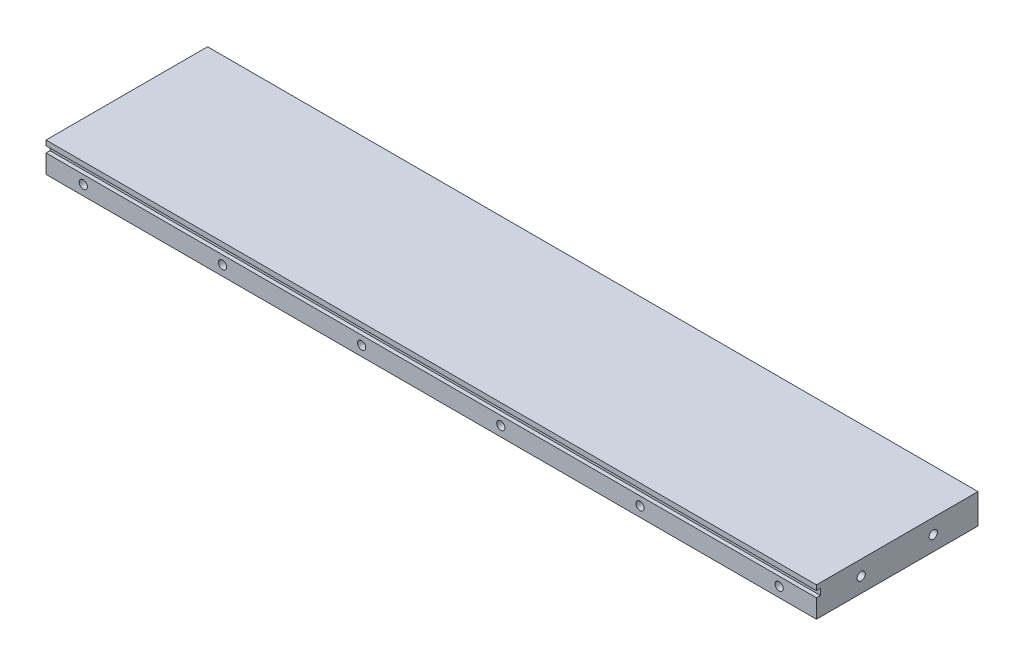
ISO-10303-21;
HEADER;
FILE_DESCRIPTION(('STEP AP214'),'2;1');
FILE_NAME('part.step','',(''),(''),'','','');
FILE_SCHEMA(('AUTOMOTIVE_DESIGN { 1 0 10303 214 1 1 1 1 }'));
ENDSEC;
DATA;
#1=APPLICATION_CONTEXT('core data for automotive mechanical design processes');
#2=APPLICATION_PROTOCOL_DEFINITION('international standard','automotive_design',2000,#1);
#3=PRODUCT_CONTEXT('',#1,'mechanical');
#4=PRODUCT('Part','Part','',(#3));
#5=PRODUCT_RELATED_PRODUCT_CATEGORY('part','',(#4));
#6=PRODUCT_DEFINITION_FORMATION('','',#4);
#7=PRODUCT_DEFINITION_CONTEXT('part definition',#1,'design');
#8=PRODUCT_DEFINITION('design','',#6,#7);
#9=PRODUCT_DEFINITION_SHAPE('','',#8);
#10=(LENGTH_UNIT() NAMED_UNIT(*) SI_UNIT(.MILLI.,.METRE.));
#11=(NAMED_UNIT(*) PLANE_ANGLE_UNIT() SI_UNIT($,.RADIAN.));
#12=(NAMED_UNIT(*) SI_UNIT($,.STERADIAN.) SOLID_ANGLE_UNIT());
#13=UNCERTAINTY_MEASURE_WITH_UNIT(LENGTH_MEASURE(1.E-05),#10,'distance_accuracy_value','');
#14=(GEOMETRIC_REPRESENTATION_CONTEXT(3) GLOBAL_UNCERTAINTY_ASSIGNED_CONTEXT((#13)) GLOBAL_UNIT_ASSIGNED_CONTEXT((#10,
#11,#12)) REPRESENTATION_CONTEXT('',''));
#15=CARTESIAN_POINT('',(0.,0.,0.));
#16=DIRECTION('',(0.,0.,1.));
#17=DIRECTION('',(1.,0.,0.));
#18=AXIS2_PLACEMENT_3D('',#15,#16,#17);
#19=CARTESIAN_POINT('',(0.,0.,0.));
#20=DIRECTION('',(0.,0.,-1.));
#21=DIRECTION('',(-1.,0.,0.));
#22=AXIS2_PLACEMENT_3D('',#19,#20,#21);
#23=PLANE('',#22);
#24=CARTESIAN_POINT('',(15.,4.,0.));
#25=DIRECTION('',(0.,0.,1.));
#26=DIRECTION('',(1.,0.,0.));
#27=AXIS2_PLACEMENT_3D('',#24,#25,#26);
#28=CIRCLE('',#27,1.65);
#29=CARTESIAN_POINT('',(16.65,4.,0.));
#30=VERTEX_POINT('',#29);
#31=EDGE_CURVE('E218',#30,#30,#28,.T.);
#32=ORIENTED_EDGE('',*,*,#31,.F.);
#33=EDGE_LOOP('',(#32));
#34=FACE_BOUND('',#33,.T.);
#35=CARTESIAN_POINT('',(71.,4.,0.));
#36=DIRECTION('',(0.,0.,1.));
#37=DIRECTION('',(1.,0.,0.));
#38=AXIS2_PLACEMENT_3D('',#35,#36,#37);
#39=CIRCLE('',#38,1.65);
#40=CARTESIAN_POINT('',(72.65,4.,0.));
#41=VERTEX_POINT('',#40);
#42=EDGE_CURVE('E226',#41,#41,#39,.T.);
#43=ORIENTED_EDGE('',*,*,#42,.F.);
#44=EDGE_LOOP('',(#43));
#45=FACE_BOUND('',#44,.T.);
#46=CARTESIAN_POINT('',(127.,4.,0.));
#47=DIRECTION('',(0.,0.,1.));
#48=DIRECTION('',(1.,0.,0.));
#49=AXIS2_PLACEMENT_3D('',#46,#47,#48);
#50=CIRCLE('',#49,1.64999999999998);
#51=CARTESIAN_POINT('',(128.65,4.,0.));
#52=VERTEX_POINT('',#51);
#53=EDGE_CURVE('E233',#52,#52,#50,.T.);
#54=ORIENTED_EDGE('',*,*,#53,.F.);
#55=EDGE_LOOP('',(#54));
#56=FACE_BOUND('',#55,.T.);
#57=CARTESIAN_POINT('',(183.,4.,0.));
#58=DIRECTION('',(0.,0.,1.));
#59=DIRECTION('',(1.,0.,0.));
#60=AXIS2_PLACEMENT_3D('',#57,#58,#59);
#61=CIRCLE('',#60,1.64999999999998);
#62=CARTESIAN_POINT('',(184.65,4.,0.));
#63=VERTEX_POINT('',#62);
#64=EDGE_CURVE('E241',#63,#63,#61,.T.);
#65=ORIENTED_EDGE('',*,*,#64,.F.);
#66=EDGE_LOOP('',(#65));
#67=FACE_BOUND('',#66,.T.);
#68=CARTESIAN_POINT('',(239.,4.,0.));
#69=DIRECTION('',(0.,0.,1.));
#70=DIRECTION('',(1.,0.,0.));
#71=AXIS2_PLACEMENT_3D('',#68,#69,#70);
#72=CIRCLE('',#71,1.64999999999998);
#73=CARTESIAN_POINT('',(240.65,4.,0.));
#74=VERTEX_POINT('',#73);
#75=EDGE_CURVE('E249',#74,#74,#72,.T.);
#76=ORIENTED_EDGE('',*,*,#75,.F.);
#77=EDGE_LOOP('',(#76));
#78=FACE_BOUND('',#77,.T.);
#79=CARTESIAN_POINT('',(295.,4.,0.));
#80=DIRECTION('',(0.,0.,1.));
#81=DIRECTION('',(1.,0.,0.));
#82=AXIS2_PLACEMENT_3D('',#79,#80,#81);
#83=CIRCLE('',#82,1.64999999999998);
#84=CARTESIAN_POINT('',(296.65,4.,0.));
#85=VERTEX_POINT('',#84);
#86=EDGE_CURVE('E257',#85,#85,#83,.T.);
#87=ORIENTED_EDGE('',*,*,#86,.F.);
#88=EDGE_LOOP('',(#87));
#89=FACE_BOUND('',#88,.T.);
#90=DIRECTION('',(0.,1.,0.));
#91=VECTOR('',#90,1.);
#92=CARTESIAN_POINT('',(310.,0.,0.));
#93=LINE('',#92,#91);
#94=CARTESIAN_POINT('',(310.,0.,0.));
#95=VERTEX_POINT('',#94);
#96=CARTESIAN_POINT('',(310.,7.5,0.));
#97=VERTEX_POINT('',#96);
#98=EDGE_CURVE('E322',#95,#97,#93,.T.);
#99=ORIENTED_EDGE('',*,*,#98,.T.);
#100=DIRECTION('',(1.,0.,0.));
#101=VECTOR('',#100,1.);
#102=CARTESIAN_POINT('',(310.,7.5,0.));
#103=LINE('',#102,#101);
#104=CARTESIAN_POINT('',(0.,7.49999999999996,0.));
#105=VERTEX_POINT('',#104);
#106=EDGE_CURVE('E270',#105,#97,#103,.T.);
#107=ORIENTED_EDGE('',*,*,#106,.F.);
#108=DIRECTION('',(0.,-1.,0.));
#109=VECTOR('',#108,1.);
#110=CARTESIAN_POINT('',(0.,0.,0.));
#111=LINE('',#110,#109);
#112=CARTESIAN_POINT('',(0.,0.,0.));
#113=VERTEX_POINT('',#112);
#114=EDGE_CURVE('E289',#105,#113,#111,.T.);
#115=ORIENTED_EDGE('',*,*,#114,.T.);
#116=DIRECTION('',(1.,0.,0.));
#117=VECTOR('',#116,1.);
#118=CARTESIAN_POINT('',(0.,0.,0.));
#119=LINE('',#118,#117);
#120=EDGE_CURVE('E317',#113,#95,#119,.T.);
#121=ORIENTED_EDGE('',*,*,#120,.T.);
#122=EDGE_LOOP('',(#99,#107,#115,#121));
#123=FACE_BOUND('',#122,.T.);
#124=ADVANCED_FACE('F48',(#34,#45,#56,#67,#78,#89,#123),#23,.F.);
#125=CARTESIAN_POINT('',(0.,0.,-65.));
#126=DIRECTION('',(-1.,0.,0.));
#127=DIRECTION('',(0.,0.,1.));
#128=AXIS2_PLACEMENT_3D('',#125,#126,#127);
#129=PLANE('',#128);
#130=CARTESIAN_POINT('',(0.,6.,-18.));
#131=DIRECTION('',(-1.,0.,0.));
#132=DIRECTION('',(0.,0.,1.));
#133=AXIS2_PLACEMENT_3D('',#130,#131,#132);
#134=CIRCLE('',#133,1.64999999999999);
#135=CARTESIAN_POINT('',(0.,6.,-16.35));
#136=VERTEX_POINT('',#135);
#137=EDGE_CURVE('E203',#136,#136,#134,.T.);
#138=ORIENTED_EDGE('',*,*,#137,.F.);
#139=EDGE_LOOP('',(#138));
#140=FACE_BOUND('',#139,.T.);
#141=CARTESIAN_POINT('',(0.,6.00000000000007,-47.));
#142=DIRECTION('',(-1.,0.,0.));
#143=DIRECTION('',(0.,0.,1.));
#144=AXIS2_PLACEMENT_3D('',#141,#142,#143);
#145=CIRCLE('',#144,1.64999999999999);
#146=CARTESIAN_POINT('',(0.,6.00000000000007,-45.35));
#147=VERTEX_POINT('',#146);
#148=EDGE_CURVE('E210',#147,#147,#145,.T.);
#149=ORIENTED_EDGE('',*,*,#148,.F.);
#150=EDGE_LOOP('',(#149));
#151=FACE_BOUND('',#150,.T.);
#152=DIRECTION('',(0.,0.,1.));
#153=VECTOR('',#152,1.);
#154=CARTESIAN_POINT('',(0.,7.49999999999996,-1.6));
#155=LINE('',#154,#153);
#156=CARTESIAN_POINT('',(0.,7.49999999999996,-1.6));
#157=VERTEX_POINT('',#156);
#158=EDGE_CURVE('E290',#157,#105,#155,.T.);
#159=ORIENTED_EDGE('',*,*,#158,.F.);
#160=DIRECTION('',(0.,-1.,0.));
#161=VECTOR('',#160,1.);
#162=CARTESIAN_POINT('',(0.,9.99999999999996,-1.6));
#163=LINE('',#162,#161);
#164=CARTESIAN_POINT('',(0.,9.99999999999996,-1.6));
#165=VERTEX_POINT('',#164);
#166=EDGE_CURVE('E274',#165,#157,#163,.T.);
#167=ORIENTED_EDGE('',*,*,#166,.F.);
#168=DIRECTION('',(0.,0.,1.));
#169=VECTOR('',#168,1.);
#170=CARTESIAN_POINT('',(0.,9.99999999999996,-1.6));
#171=LINE('',#170,#169);
#172=CARTESIAN_POINT('',(0.,9.99999999999996,0.));
#173=VERTEX_POINT('',#172);
#174=EDGE_CURVE('E293',#165,#173,#171,.T.);
#175=ORIENTED_EDGE('',*,*,#174,.T.);
#176=CARTESIAN_POINT('',(0.,12.,0.));
#177=VERTEX_POINT('',#176);
#178=EDGE_CURVE('E313',#177,#173,#111,.T.);
#179=ORIENTED_EDGE('',*,*,#178,.F.);
#180=DIRECTION('',(0.,0.,1.));
#181=VECTOR('',#180,1.);
#182=CARTESIAN_POINT('',(0.,12.,-65.));
#183=LINE('',#182,#181);
#184=CARTESIAN_POINT('',(0.,12.,-65.));
#185=VERTEX_POINT('',#184);
#186=EDGE_CURVE('E11',#185,#177,#183,.T.);
#187=ORIENTED_EDGE('',*,*,#186,.F.);
#188=DIRECTION('',(0.,-1.,0.));
#189=VECTOR('',#188,1.);
#190=CARTESIAN_POINT('',(0.,0.,-65.));
#191=LINE('',#190,#189);
#192=CARTESIAN_POINT('',(0.,0.,-65.));
#193=VERTEX_POINT('',#192);
#194=EDGE_CURVE('E299',#185,#193,#191,.T.);
#195=ORIENTED_EDGE('',*,*,#194,.T.);
#196=DIRECTION('',(0.,0.,1.));
#197=VECTOR('',#196,1.);
#198=CARTESIAN_POINT('',(0.,0.,-65.));
#199=LINE('',#198,#197);
#200=EDGE_CURVE('E52',#193,#113,#199,.T.);
#201=ORIENTED_EDGE('',*,*,#200,.T.);
#202=ORIENTED_EDGE('',*,*,#114,.F.);
#203=EDGE_LOOP('',(#159,#167,#175,#179,#187,#195,#201,#202));
#204=FACE_BOUND('',#203,.T.);
#205=ADVANCED_FACE('F50',(#140,#151,#204),#129,.T.);
#206=CARTESIAN_POINT('',(0.,12.,-65.));
#207=DIRECTION('',(0.,1.,0.));
#208=DIRECTION('',(0.,0.,1.));
#209=AXIS2_PLACEMENT_3D('',#206,#207,#208);
#210=PLANE('',#209);
#211=DIRECTION('',(-1.,0.,0.));
#212=VECTOR('',#211,1.);
#213=CARTESIAN_POINT('',(0.,12.,0.));
#214=LINE('',#213,#212);
#215=CARTESIAN_POINT('',(310.,12.,0.));
#216=VERTEX_POINT('',#215);
#217=EDGE_CURVE('E303',#216,#177,#214,.T.);
#218=ORIENTED_EDGE('',*,*,#217,.F.);
#219=DIRECTION('',(0.,0.,1.));
#220=VECTOR('',#219,1.);
#221=CARTESIAN_POINT('',(310.,12.,-65.));
#222=LINE('',#221,#220);
#223=CARTESIAN_POINT('',(310.,12.,-65.));
#224=VERTEX_POINT('',#223);
#225=EDGE_CURVE('E58',#224,#216,#222,.T.);
#226=ORIENTED_EDGE('',*,*,#225,.F.);
#227=DIRECTION('',(-1.,0.,0.));
#228=VECTOR('',#227,1.);
#229=CARTESIAN_POINT('',(0.,12.,-65.));
#230=LINE('',#229,#228);
#231=EDGE_CURVE('E310',#224,#185,#230,.T.);
#232=ORIENTED_EDGE('',*,*,#231,.T.);
#233=ORIENTED_EDGE('',*,*,#186,.T.);
#234=EDGE_LOOP('',(#218,#226,#232,#233));
#235=FACE_BOUND('',#234,.T.);
#236=ADVANCED_FACE('F353',(#235),#210,.T.);
#237=CARTESIAN_POINT('',(310.,0.,-65.));
#238=DIRECTION('',(1.,0.,0.));
#239=DIRECTION('',(0.,0.,-1.));
#240=AXIS2_PLACEMENT_3D('',#237,#238,#239);
#241=PLANE('',#240);
#242=CARTESIAN_POINT('',(310.,6.,-18.));
#243=DIRECTION('',(1.,0.,0.));
#244=DIRECTION('',(0.,0.,-1.));
#245=AXIS2_PLACEMENT_3D('',#242,#243,#244);
#246=CIRCLE('',#245,1.64999999999999);
#247=CARTESIAN_POINT('',(310.,6.,-19.65));
#248=VERTEX_POINT('',#247);
#249=EDGE_CURVE('E188',#248,#248,#246,.T.);
#250=ORIENTED_EDGE('',*,*,#249,.F.);
#251=EDGE_LOOP('',(#250));
#252=FACE_BOUND('',#251,.T.);
#253=CARTESIAN_POINT('',(310.,6.00000000000007,-47.));
#254=DIRECTION('',(1.,0.,0.));
#255=DIRECTION('',(0.,0.,-1.));
#256=AXIS2_PLACEMENT_3D('',#253,#254,#255);
#257=CIRCLE('',#256,1.64999999999999);
#258=CARTESIAN_POINT('',(310.,6.00000000000007,-48.65));
#259=VERTEX_POINT('',#258);
#260=EDGE_CURVE('E187',#259,#259,#257,.T.);
#261=ORIENTED_EDGE('',*,*,#260,.F.);
#262=EDGE_LOOP('',(#261));
#263=FACE_BOUND('',#262,.T.);
#264=DIRECTION('',(0.,0.,1.));
#265=VECTOR('',#264,1.);
#266=CARTESIAN_POINT('',(310.,7.5,-1.6));
#267=LINE('',#266,#265);
#268=CARTESIAN_POINT('',(310.,7.5,-1.6));
#269=VERTEX_POINT('',#268);
#270=EDGE_CURVE('E285',#269,#97,#267,.T.);
#271=ORIENTED_EDGE('',*,*,#270,.T.);
#272=ORIENTED_EDGE('',*,*,#98,.F.);
#273=DIRECTION('',(0.,0.,1.));
#274=VECTOR('',#273,1.);
#275=CARTESIAN_POINT('',(310.,0.,-65.));
#276=LINE('',#275,#274);
#277=CARTESIAN_POINT('',(310.,0.,-65.));
#278=VERTEX_POINT('',#277);
#279=EDGE_CURVE('E331',#278,#95,#276,.T.);
#280=ORIENTED_EDGE('',*,*,#279,.F.);
#281=DIRECTION('',(0.,1.,0.));
#282=VECTOR('',#281,1.);
#283=CARTESIAN_POINT('',(310.,0.,-65.));
#284=LINE('',#283,#282);
#285=EDGE_CURVE('E306',#278,#224,#284,.T.);
#286=ORIENTED_EDGE('',*,*,#285,.T.);
#287=ORIENTED_EDGE('',*,*,#225,.T.);
#288=CARTESIAN_POINT('',(310.,9.99999999999998,0.));
#289=VERTEX_POINT('',#288);
#290=EDGE_CURVE('E321',#289,#216,#93,.T.);
#291=ORIENTED_EDGE('',*,*,#290,.F.);
#292=DIRECTION('',(0.,0.,1.));
#293=VECTOR('',#292,1.);
#294=CARTESIAN_POINT('',(310.,10.,-1.6));
#295=LINE('',#294,#293);
#296=CARTESIAN_POINT('',(310.,10.,-1.6));
#297=VERTEX_POINT('',#296);
#298=EDGE_CURVE('E69',#297,#289,#295,.T.);
#299=ORIENTED_EDGE('',*,*,#298,.F.);
#300=DIRECTION('',(0.,1.,0.));
#301=VECTOR('',#300,1.);
#302=CARTESIAN_POINT('',(310.,10.,-1.6));
#303=LINE('',#302,#301);
#304=EDGE_CURVE('E265',#269,#297,#303,.T.);
#305=ORIENTED_EDGE('',*,*,#304,.F.);
#306=EDGE_LOOP('',(#271,#272,#280,#286,#287,#291,#299,#305));
#307=FACE_BOUND('',#306,.T.);
#308=ADVANCED_FACE('F346',(#252,#263,#307),#241,.T.);
#309=CARTESIAN_POINT('',(0.,0.,-65.));
#310=DIRECTION('',(0.,-1.,0.));
#311=DIRECTION('',(0.,0.,-1.));
#312=AXIS2_PLACEMENT_3D('',#309,#310,#311);
#313=PLANE('',#312);
#314=ORIENTED_EDGE('',*,*,#120,.F.);
#315=ORIENTED_EDGE('',*,*,#200,.F.);
#316=DIRECTION('',(1.,0.,0.));
#317=VECTOR('',#316,1.);
#318=CARTESIAN_POINT('',(0.,0.,-65.));
#319=LINE('',#318,#317);
#320=EDGE_CURVE('E302',#193,#278,#319,.T.);
#321=ORIENTED_EDGE('',*,*,#320,.T.);
#322=ORIENTED_EDGE('',*,*,#279,.T.);
#323=EDGE_LOOP('',(#314,#315,#321,#322));
#324=FACE_BOUND('',#323,.T.);
#325=ADVANCED_FACE('F338',(#324),#313,.T.);
#326=CARTESIAN_POINT('',(0.,0.,-65.));
#327=DIRECTION('',(0.,0.,-1.));
#328=DIRECTION('',(-1.,0.,0.));
#329=AXIS2_PLACEMENT_3D('',#326,#327,#328);
#330=PLANE('',#329);
#331=ORIENTED_EDGE('',*,*,#194,.F.);
#332=ORIENTED_EDGE('',*,*,#231,.F.);
#333=ORIENTED_EDGE('',*,*,#285,.F.);
#334=ORIENTED_EDGE('',*,*,#320,.F.);
#335=EDGE_LOOP('',(#331,#332,#333,#334));
#336=FACE_BOUND('',#335,.T.);
#337=ADVANCED_FACE('F357',(#336),#330,.T.);
#338=ORIENTED_EDGE('',*,*,#178,.T.);
#339=DIRECTION('',(-1.,0.,0.));
#340=VECTOR('',#339,1.);
#341=CARTESIAN_POINT('',(310.,10.,0.));
#342=LINE('',#341,#340);
#343=EDGE_CURVE('E264',#289,#173,#342,.T.);
#344=ORIENTED_EDGE('',*,*,#343,.F.);
#345=ORIENTED_EDGE('',*,*,#290,.T.);
#346=ORIENTED_EDGE('',*,*,#217,.T.);
#347=EDGE_LOOP('',(#338,#344,#345,#346));
#348=FACE_BOUND('',#347,.T.);
#349=ADVANCED_FACE('F352',(#348),#23,.F.);
#350=CARTESIAN_POINT('',(310.,7.5,-1.6));
#351=DIRECTION('',(0.,-1.,0.));
#352=DIRECTION('',(1.,0.,0.));
#353=AXIS2_PLACEMENT_3D('',#350,#351,#352);
#354=PLANE('',#353);
#355=ORIENTED_EDGE('',*,*,#106,.T.);
#356=ORIENTED_EDGE('',*,*,#270,.F.);
#357=DIRECTION('',(1.,0.,0.));
#358=VECTOR('',#357,1.);
#359=CARTESIAN_POINT('',(310.,7.5,-1.6));
#360=LINE('',#359,#358);
#361=EDGE_CURVE('E277',#157,#269,#360,.T.);
#362=ORIENTED_EDGE('',*,*,#361,.F.);
#363=ORIENTED_EDGE('',*,*,#158,.T.);
#364=EDGE_LOOP('',(#355,#356,#362,#363));
#365=FACE_BOUND('',#364,.T.);
#366=ADVANCED_FACE('F342',(#365),#354,.F.);
#367=CARTESIAN_POINT('',(310.,10.,-1.6));
#368=DIRECTION('',(0.,1.,0.));
#369=DIRECTION('',(-1.,0.,0.));
#370=AXIS2_PLACEMENT_3D('',#367,#368,#369);
#371=PLANE('',#370);
#372=ORIENTED_EDGE('',*,*,#343,.T.);
#373=ORIENTED_EDGE('',*,*,#174,.F.);
#374=DIRECTION('',(-1.,0.,0.));
#375=VECTOR('',#374,1.);
#376=CARTESIAN_POINT('',(310.,10.,-1.6));
#377=LINE('',#376,#375);
#378=EDGE_CURVE('E269',#297,#165,#377,.T.);
#379=ORIENTED_EDGE('',*,*,#378,.F.);
#380=ORIENTED_EDGE('',*,*,#298,.T.);
#381=EDGE_LOOP('',(#372,#373,#379,#380));
#382=FACE_BOUND('',#381,.T.);
#383=ADVANCED_FACE('F461',(#382),#371,.F.);
#384=CARTESIAN_POINT('',(0.,0.,-1.6));
#385=DIRECTION('',(0.,0.,-1.));
#386=DIRECTION('',(-1.,0.,0.));
#387=AXIS2_PLACEMENT_3D('',#384,#385,#386);
#388=PLANE('',#387);
#389=ORIENTED_EDGE('',*,*,#304,.T.);
#390=ORIENTED_EDGE('',*,*,#378,.T.);
#391=ORIENTED_EDGE('',*,*,#166,.T.);
#392=ORIENTED_EDGE('',*,*,#361,.T.);
#393=EDGE_LOOP('',(#389,#390,#391,#392));
#394=FACE_BOUND('',#393,.T.);
#395=ADVANCED_FACE('F349',(#394),#388,.F.);
#396=CARTESIAN_POINT('',(295.,4.,-11.5));
#397=DIRECTION('',(0.,0.,1.));
#398=DIRECTION('',(1.,0.,0.));
#399=AXIS2_PLACEMENT_3D('',#396,#397,#398);
#400=CONICAL_SURFACE('',#399,1.64999999999998,1.02974425867665);
#401=CARTESIAN_POINT('',(295.,4.,-12.4914200213955));
#402=VERTEX_POINT('',#401);
#403=VERTEX_LOOP('',#402);
#404=FACE_BOUND('',#403,.T.);
#405=CARTESIAN_POINT('',(295.,4.,-11.5));
#406=DIRECTION('',(0.,0.,1.));
#407=DIRECTION('',(1.,0.,0.));
#408=AXIS2_PLACEMENT_3D('',#405,#406,#407);
#409=CIRCLE('',#408,1.64999999999998);
#410=CARTESIAN_POINT('',(296.65,4.,-11.5));
#411=VERTEX_POINT('',#410);
#412=EDGE_CURVE('E261',#411,#411,#409,.T.);
#413=ORIENTED_EDGE('',*,*,#412,.T.);
#414=EDGE_LOOP('',(#413));
#415=FACE_BOUND('',#414,.T.);
#416=ADVANCED_FACE('F454',(#404,#415),#400,.F.);
#417=CARTESIAN_POINT('',(295.,4.,0.));
#418=DIRECTION('',(0.,0.,1.));
#419=DIRECTION('',(1.,0.,0.));
#420=AXIS2_PLACEMENT_3D('',#417,#418,#419);
#421=CYLINDRICAL_SURFACE('',#420,1.64999999999998);
#422=ORIENTED_EDGE('',*,*,#412,.F.);
#423=EDGE_LOOP('',(#422));
#424=FACE_BOUND('',#423,.T.);
#425=ORIENTED_EDGE('',*,*,#86,.T.);
#426=EDGE_LOOP('',(#425));
#427=FACE_BOUND('',#426,.T.);
#428=ADVANCED_FACE('F450',(#424,#427),#421,.F.);
#429=CARTESIAN_POINT('',(239.,4.,-11.5));
#430=DIRECTION('',(0.,0.,1.));
#431=DIRECTION('',(1.,0.,0.));
#432=AXIS2_PLACEMENT_3D('',#429,#430,#431);
#433=CONICAL_SURFACE('',#432,1.64999999999998,1.02974425867665);
#434=CARTESIAN_POINT('',(239.,4.,-12.4914200213955));
#435=VERTEX_POINT('',#434);
#436=VERTEX_LOOP('',#435);
#437=FACE_BOUND('',#436,.T.);
#438=CARTESIAN_POINT('',(239.,4.,-11.5));
#439=DIRECTION('',(0.,0.,1.));
#440=DIRECTION('',(1.,0.,0.));
#441=AXIS2_PLACEMENT_3D('',#438,#439,#440);
#442=CIRCLE('',#441,1.64999999999998);
#443=CARTESIAN_POINT('',(240.65,4.,-11.5));
#444=VERTEX_POINT('',#443);
#445=EDGE_CURVE('E253',#444,#444,#442,.T.);
#446=ORIENTED_EDGE('',*,*,#445,.T.);
#447=EDGE_LOOP('',(#446));
#448=FACE_BOUND('',#447,.T.);
#449=ADVANCED_FACE('F446',(#437,#448),#433,.F.);
#450=CARTESIAN_POINT('',(239.,4.,0.));
#451=DIRECTION('',(0.,0.,1.));
#452=DIRECTION('',(1.,0.,0.));
#453=AXIS2_PLACEMENT_3D('',#450,#451,#452);
#454=CYLINDRICAL_SURFACE('',#453,1.64999999999998);
#455=ORIENTED_EDGE('',*,*,#445,.F.);
#456=EDGE_LOOP('',(#455));
#457=FACE_BOUND('',#456,.T.);
#458=ORIENTED_EDGE('',*,*,#75,.T.);
#459=EDGE_LOOP('',(#458));
#460=FACE_BOUND('',#459,.T.);
#461=ADVANCED_FACE('F442',(#457,#460),#454,.F.);
#462=CARTESIAN_POINT('',(183.,4.,-11.5));
#463=DIRECTION('',(0.,0.,1.));
#464=DIRECTION('',(1.,0.,0.));
#465=AXIS2_PLACEMENT_3D('',#462,#463,#464);
#466=CONICAL_SURFACE('',#465,1.64999999999998,1.02974425867665);
#467=CARTESIAN_POINT('',(183.,4.,-12.4914200213955));
#468=VERTEX_POINT('',#467);
#469=VERTEX_LOOP('',#468);
#470=FACE_BOUND('',#469,.T.);
#471=CARTESIAN_POINT('',(183.,4.,-11.5));
#472=DIRECTION('',(0.,0.,1.));
#473=DIRECTION('',(1.,0.,0.));
#474=AXIS2_PLACEMENT_3D('',#471,#472,#473);
#475=CIRCLE('',#474,1.64999999999998);
#476=CARTESIAN_POINT('',(184.65,4.,-11.5));
#477=VERTEX_POINT('',#476);
#478=EDGE_CURVE('E245',#477,#477,#475,.T.);
#479=ORIENTED_EDGE('',*,*,#478,.T.);
#480=EDGE_LOOP('',(#479));
#481=FACE_BOUND('',#480,.T.);
#482=ADVANCED_FACE('F438',(#470,#481),#466,.F.);
#483=CARTESIAN_POINT('',(183.,4.,0.));
#484=DIRECTION('',(0.,0.,1.));
#485=DIRECTION('',(1.,0.,0.));
#486=AXIS2_PLACEMENT_3D('',#483,#484,#485);
#487=CYLINDRICAL_SURFACE('',#486,1.64999999999998);
#488=ORIENTED_EDGE('',*,*,#478,.F.);
#489=EDGE_LOOP('',(#488));
#490=FACE_BOUND('',#489,.T.);
#491=ORIENTED_EDGE('',*,*,#64,.T.);
#492=EDGE_LOOP('',(#491));
#493=FACE_BOUND('',#492,.T.);
#494=ADVANCED_FACE('F434',(#490,#493),#487,.F.);
#495=CARTESIAN_POINT('',(127.,4.,-11.5));
#496=DIRECTION('',(0.,0.,1.));
#497=DIRECTION('',(1.,0.,0.));
#498=AXIS2_PLACEMENT_3D('',#495,#496,#497);
#499=CONICAL_SURFACE('',#498,1.64999999999998,1.02974425867665);
#500=CARTESIAN_POINT('',(127.,4.,-12.4914200213955));
#501=VERTEX_POINT('',#500);
#502=VERTEX_LOOP('',#501);
#503=FACE_BOUND('',#502,.T.);
#504=CARTESIAN_POINT('',(127.,4.,-11.5));
#505=DIRECTION('',(0.,0.,1.));
#506=DIRECTION('',(1.,0.,0.));
#507=AXIS2_PLACEMENT_3D('',#504,#505,#506);
#508=CIRCLE('',#507,1.64999999999998);
#509=CARTESIAN_POINT('',(128.65,4.,-11.5));
#510=VERTEX_POINT('',#509);
#511=EDGE_CURVE('E237',#510,#510,#508,.T.);
#512=ORIENTED_EDGE('',*,*,#511,.T.);
#513=EDGE_LOOP('',(#512));
#514=FACE_BOUND('',#513,.T.);
#515=ADVANCED_FACE('F430',(#503,#514),#499,.F.);
#516=CARTESIAN_POINT('',(127.,4.,0.));
#517=DIRECTION('',(0.,0.,1.));
#518=DIRECTION('',(1.,0.,0.));
#519=AXIS2_PLACEMENT_3D('',#516,#517,#518);
#520=CYLINDRICAL_SURFACE('',#519,1.64999999999998);
#521=ORIENTED_EDGE('',*,*,#511,.F.);
#522=EDGE_LOOP('',(#521));
#523=FACE_BOUND('',#522,.T.);
#524=ORIENTED_EDGE('',*,*,#53,.T.);
#525=EDGE_LOOP('',(#524));
#526=FACE_BOUND('',#525,.T.);
#527=ADVANCED_FACE('F426',(#523,#526),#520,.F.);
#528=CARTESIAN_POINT('',(71.,4.,-11.5));
#529=DIRECTION('',(0.,0.,1.));
#530=DIRECTION('',(1.,0.,0.));
#531=AXIS2_PLACEMENT_3D('',#528,#529,#530);
#532=CONICAL_SURFACE('',#531,1.65,1.02974425867665);
#533=CARTESIAN_POINT('',(71.,4.,-12.4914200213955));
#534=VERTEX_POINT('',#533);
#535=VERTEX_LOOP('',#534);
#536=FACE_BOUND('',#535,.T.);
#537=CARTESIAN_POINT('',(71.,4.,-11.5));
#538=DIRECTION('',(0.,0.,1.));
#539=DIRECTION('',(1.,0.,0.));
#540=AXIS2_PLACEMENT_3D('',#537,#538,#539);
#541=CIRCLE('',#540,1.65);
#542=CARTESIAN_POINT('',(72.65,4.,-11.5));
#543=VERTEX_POINT('',#542);
#544=EDGE_CURVE('E229',#543,#543,#541,.T.);
#545=ORIENTED_EDGE('',*,*,#544,.T.);
#546=EDGE_LOOP('',(#545));
#547=FACE_BOUND('',#546,.T.);
#548=ADVANCED_FACE('F422',(#536,#547),#532,.F.);
#549=CARTESIAN_POINT('',(71.,4.,0.));
#550=DIRECTION('',(0.,0.,1.));
#551=DIRECTION('',(1.,0.,0.));
#552=AXIS2_PLACEMENT_3D('',#549,#550,#551);
#553=CYLINDRICAL_SURFACE('',#552,1.65);
#554=ORIENTED_EDGE('',*,*,#544,.F.);
#555=EDGE_LOOP('',(#554));
#556=FACE_BOUND('',#555,.T.);
#557=ORIENTED_EDGE('',*,*,#42,.T.);
#558=EDGE_LOOP('',(#557));
#559=FACE_BOUND('',#558,.T.);
#560=ADVANCED_FACE('F418',(#556,#559),#553,.F.);
#561=CARTESIAN_POINT('',(15.,4.,-11.5));
#562=DIRECTION('',(0.,0.,1.));
#563=DIRECTION('',(1.,0.,0.));
#564=AXIS2_PLACEMENT_3D('',#561,#562,#563);
#565=CONICAL_SURFACE('',#564,1.65,1.02974425867665);
#566=CARTESIAN_POINT('',(15.,4.,-12.4914200213955));
#567=VERTEX_POINT('',#566);
#568=VERTEX_LOOP('',#567);
#569=FACE_BOUND('',#568,.T.);
#570=CARTESIAN_POINT('',(15.,4.,-11.5));
#571=DIRECTION('',(0.,0.,1.));
#572=DIRECTION('',(1.,0.,0.));
#573=AXIS2_PLACEMENT_3D('',#570,#571,#572);
#574=CIRCLE('',#573,1.65);
#575=CARTESIAN_POINT('',(16.65,4.,-11.5));
#576=VERTEX_POINT('',#575);
#577=EDGE_CURVE('E222',#576,#576,#574,.T.);
#578=ORIENTED_EDGE('',*,*,#577,.T.);
#579=EDGE_LOOP('',(#578));
#580=FACE_BOUND('',#579,.T.);
#581=ADVANCED_FACE('F414',(#569,#580),#565,.F.);
#582=CARTESIAN_POINT('',(15.,4.,0.));
#583=DIRECTION('',(0.,0.,1.));
#584=DIRECTION('',(1.,0.,0.));
#585=AXIS2_PLACEMENT_3D('',#582,#583,#584);
#586=CYLINDRICAL_SURFACE('',#585,1.65);
#587=ORIENTED_EDGE('',*,*,#577,.F.);
#588=EDGE_LOOP('',(#587));
#589=FACE_BOUND('',#588,.T.);
#590=ORIENTED_EDGE('',*,*,#31,.T.);
#591=EDGE_LOOP('',(#590));
#592=FACE_BOUND('',#591,.T.);
#593=ADVANCED_FACE('F410',(#589,#592),#586,.F.);
#594=CARTESIAN_POINT('',(11.5,6.00000000000007,-47.));
#595=DIRECTION('',(-1.,0.,0.));
#596=DIRECTION('',(0.,0.,1.));
#597=AXIS2_PLACEMENT_3D('',#594,#595,#596);
#598=CONICAL_SURFACE('',#597,1.64999999999999,1.02974425867665);
#599=CARTESIAN_POINT('',(12.4914200213955,6.00000000000007,-47.));
#600=VERTEX_POINT('',#599);
#601=VERTEX_LOOP('',#600);
#602=FACE_BOUND('',#601,.T.);
#603=CARTESIAN_POINT('',(11.5,6.00000000000007,-47.));
#604=DIRECTION('',(-1.,0.,0.));
#605=DIRECTION('',(0.,0.,1.));
#606=AXIS2_PLACEMENT_3D('',#603,#604,#605);
#607=CIRCLE('',#606,1.64999999999999);
#608=CARTESIAN_POINT('',(11.5,6.00000000000007,-45.35));
#609=VERTEX_POINT('',#608);
#610=EDGE_CURVE('E214',#609,#609,#607,.T.);
#611=ORIENTED_EDGE('',*,*,#610,.T.);
#612=EDGE_LOOP('',(#611));
#613=FACE_BOUND('',#612,.T.);
#614=ADVANCED_FACE('F406',(#602,#613),#598,.F.);
#615=CARTESIAN_POINT('',(0.,6.00000000000007,-47.));
#616=DIRECTION('',(-1.,0.,0.));
#617=DIRECTION('',(0.,0.,1.));
#618=AXIS2_PLACEMENT_3D('',#615,#616,#617);
#619=CYLINDRICAL_SURFACE('',#618,1.64999999999999);
#620=ORIENTED_EDGE('',*,*,#610,.F.);
#621=EDGE_LOOP('',(#620));
#622=FACE_BOUND('',#621,.T.);
#623=ORIENTED_EDGE('',*,*,#148,.T.);
#624=EDGE_LOOP('',(#623));
#625=FACE_BOUND('',#624,.T.);
#626=ADVANCED_FACE('F402',(#622,#625),#619,.F.);
#627=CARTESIAN_POINT('',(11.5,6.,-18.));
#628=DIRECTION('',(-1.,0.,0.));
#629=DIRECTION('',(0.,0.,1.));
#630=AXIS2_PLACEMENT_3D('',#627,#628,#629);
#631=CONICAL_SURFACE('',#630,1.64999999999999,1.02974425867665);
#632=CARTESIAN_POINT('',(12.4914200213955,6.,-18.));
#633=VERTEX_POINT('',#632);
#634=VERTEX_LOOP('',#633);
#635=FACE_BOUND('',#634,.T.);
#636=CARTESIAN_POINT('',(11.5,6.,-18.));
#637=DIRECTION('',(-1.,0.,0.));
#638=DIRECTION('',(0.,0.,1.));
#639=AXIS2_PLACEMENT_3D('',#636,#637,#638);
#640=CIRCLE('',#639,1.64999999999999);
#641=CARTESIAN_POINT('',(11.5,6.,-16.35));
#642=VERTEX_POINT('',#641);
#643=EDGE_CURVE('E206',#642,#642,#640,.T.);
#644=ORIENTED_EDGE('',*,*,#643,.T.);
#645=EDGE_LOOP('',(#644));
#646=FACE_BOUND('',#645,.T.);
#647=ADVANCED_FACE('F398',(#635,#646),#631,.F.);
#648=CARTESIAN_POINT('',(0.,6.,-18.));
#649=DIRECTION('',(-1.,0.,0.));
#650=DIRECTION('',(0.,0.,1.));
#651=AXIS2_PLACEMENT_3D('',#648,#649,#650);
#652=CYLINDRICAL_SURFACE('',#651,1.64999999999999);
#653=ORIENTED_EDGE('',*,*,#643,.F.);
#654=EDGE_LOOP('',(#653));
#655=FACE_BOUND('',#654,.T.);
#656=ORIENTED_EDGE('',*,*,#137,.T.);
#657=EDGE_LOOP('',(#656));
#658=FACE_BOUND('',#657,.T.);
#659=ADVANCED_FACE('F390',(#655,#658),#652,.F.);
#660=CARTESIAN_POINT('',(298.5,6.00000000000007,-47.));
#661=DIRECTION('',(1.,0.,0.));
#662=DIRECTION('',(0.,0.,-1.));
#663=AXIS2_PLACEMENT_3D('',#660,#661,#662);
#664=CONICAL_SURFACE('',#663,1.64999999999999,1.02974425867666);
#665=CARTESIAN_POINT('',(297.508579978605,6.00000000000007,-47.));
#666=VERTEX_POINT('',#665);
#667=VERTEX_LOOP('',#666);
#668=FACE_BOUND('',#667,.T.);
#669=CARTESIAN_POINT('',(298.5,6.00000000000007,-47.));
#670=DIRECTION('',(1.,0.,0.));
#671=DIRECTION('',(0.,0.,-1.));
#672=AXIS2_PLACEMENT_3D('',#669,#670,#671);
#673=CIRCLE('',#672,1.64999999999999);
#674=CARTESIAN_POINT('',(298.5,6.00000000000007,-48.65));
#675=VERTEX_POINT('',#674);
#676=EDGE_CURVE('E194',#675,#675,#673,.T.);
#677=ORIENTED_EDGE('',*,*,#676,.T.);
#678=EDGE_LOOP('',(#677));
#679=FACE_BOUND('',#678,.T.);
#680=ADVANCED_FACE('F384',(#668,#679),#664,.F.);
#681=CARTESIAN_POINT('',(310.,6.00000000000007,-47.));
#682=DIRECTION('',(1.,0.,0.));
#683=DIRECTION('',(0.,0.,-1.));
#684=AXIS2_PLACEMENT_3D('',#681,#682,#683);
#685=CYLINDRICAL_SURFACE('',#684,1.64999999999999);
#686=ORIENTED_EDGE('',*,*,#676,.F.);
#687=EDGE_LOOP('',(#686));
#688=FACE_BOUND('',#687,.T.);
#689=ORIENTED_EDGE('',*,*,#260,.T.);
#690=EDGE_LOOP('',(#689));
#691=FACE_BOUND('',#690,.T.);
#692=ADVANCED_FACE('F180',(#688,#691),#685,.F.);
#693=CARTESIAN_POINT('',(298.5,6.,-18.));
#694=DIRECTION('',(1.,0.,0.));
#695=DIRECTION('',(0.,0.,-1.));
#696=AXIS2_PLACEMENT_3D('',#693,#694,#695);
#697=CONICAL_SURFACE('',#696,1.64999999999999,1.02974425867666);
#698=CARTESIAN_POINT('',(297.508579978605,6.,-18.));
#699=VERTEX_POINT('',#698);
#700=VERTEX_LOOP('',#699);
#701=FACE_BOUND('',#700,.T.);
#702=CARTESIAN_POINT('',(298.5,6.,-18.));
#703=DIRECTION('',(1.,0.,0.));
#704=DIRECTION('',(0.,0.,-1.));
#705=AXIS2_PLACEMENT_3D('',#702,#703,#704);
#706=CIRCLE('',#705,1.64999999999999);
#707=CARTESIAN_POINT('',(298.5,6.,-19.65));
#708=VERTEX_POINT('',#707);
#709=EDGE_CURVE('E184',#708,#708,#706,.T.);
#710=ORIENTED_EDGE('',*,*,#709,.T.);
#711=EDGE_LOOP('',(#710));
#712=FACE_BOUND('',#711,.T.);
#713=ADVANCED_FACE('F176',(#701,#712),#697,.F.);
#714=CARTESIAN_POINT('',(310.,6.,-18.));
#715=DIRECTION('',(1.,0.,0.));
#716=DIRECTION('',(0.,0.,-1.));
#717=AXIS2_PLACEMENT_3D('',#714,#715,#716);
#718=CYLINDRICAL_SURFACE('',#717,1.64999999999999);
#719=ORIENTED_EDGE('',*,*,#709,.F.);
#720=EDGE_LOOP('',(#719));
#721=FACE_BOUND('',#720,.T.);
#722=ORIENTED_EDGE('',*,*,#249,.T.);
#723=EDGE_LOOP('',(#722));
#724=FACE_BOUND('',#723,.T.);
#725=ADVANCED_FACE('F179',(#721,#724),#718,.F.);
#726=CLOSED_SHELL('',(#124,#205,#236,#308,#325,#337,#349,#366,#383,#395,#416,#428,#449,#461,
#482,#494,#515,#527,#548,#560,#581,#593,#614,#626,#647,#659,#680,#692,#713,#725));
#727=MANIFOLD_SOLID_BREP('B2',#726);
#728=ADVANCED_BREP_SHAPE_REPRESENTATION('',(#18,#727),#14);
#729=SHAPE_DEFINITION_REPRESENTATION(#9,#728);
ENDSEC;
END-ISO-10303-21;
